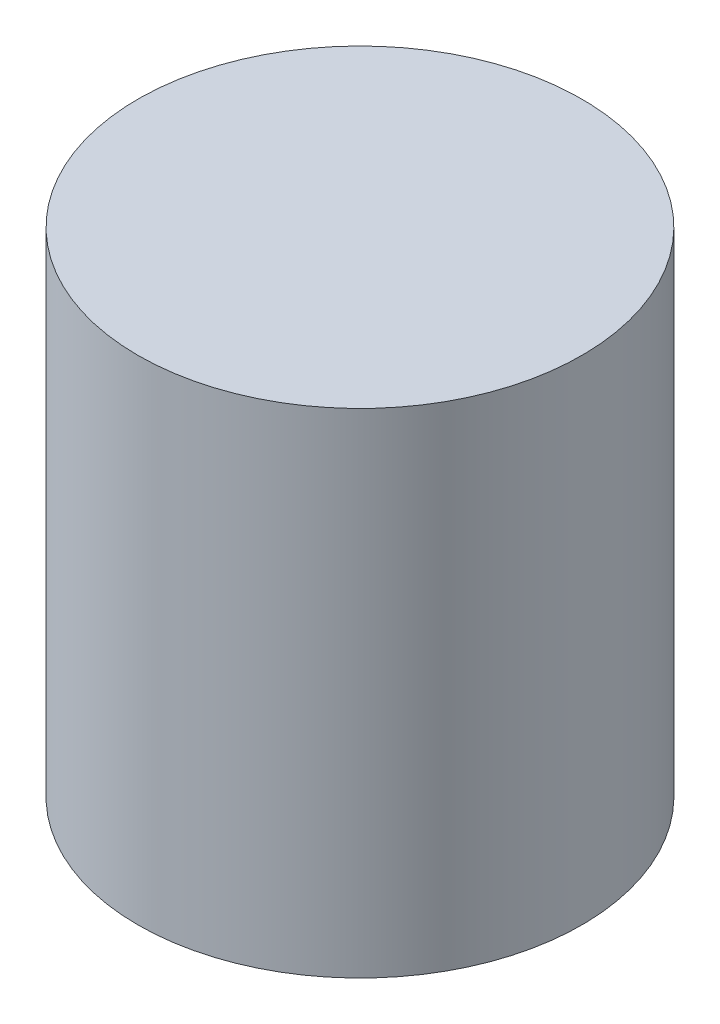
ISO-10303-21;
HEADER;
FILE_DESCRIPTION(('STEP AP214'),'2;1');
FILE_NAME('part.step','',(''),(''),'','','');
FILE_SCHEMA(('AUTOMOTIVE_DESIGN { 1 0 10303 214 1 1 1 1 }'));
ENDSEC;
DATA;
#1=APPLICATION_CONTEXT('core data for automotive mechanical design processes');
#2=APPLICATION_PROTOCOL_DEFINITION('international standard','automotive_design',2000,#1);
#3=PRODUCT_CONTEXT('',#1,'mechanical');
#4=PRODUCT('Part','Part','',(#3));
#5=PRODUCT_RELATED_PRODUCT_CATEGORY('part','',(#4));
#6=PRODUCT_DEFINITION_FORMATION('','',#4);
#7=PRODUCT_DEFINITION_CONTEXT('part definition',#1,'design');
#8=PRODUCT_DEFINITION('design','',#6,#7);
#9=PRODUCT_DEFINITION_SHAPE('','',#8);
#10=(LENGTH_UNIT() NAMED_UNIT(*) SI_UNIT(.MILLI.,.METRE.));
#11=(NAMED_UNIT(*) PLANE_ANGLE_UNIT() SI_UNIT($,.RADIAN.));
#12=(NAMED_UNIT(*) SI_UNIT($,.STERADIAN.) SOLID_ANGLE_UNIT());
#13=UNCERTAINTY_MEASURE_WITH_UNIT(LENGTH_MEASURE(1.E-05),#10,'distance_accuracy_value','');
#14=(GEOMETRIC_REPRESENTATION_CONTEXT(3) GLOBAL_UNCERTAINTY_ASSIGNED_CONTEXT((#13)) GLOBAL_UNIT_ASSIGNED_CONTEXT((#10,
#11,#12)) REPRESENTATION_CONTEXT('',''));
#15=CARTESIAN_POINT('',(0.,0.,0.));
#16=DIRECTION('',(0.,0.,1.));
#17=DIRECTION('',(1.,0.,0.));
#18=AXIS2_PLACEMENT_3D('',#15,#16,#17);
#19=CARTESIAN_POINT('',(0.,100.,0.));
#20=DIRECTION('',(0.,-1.,0.));
#21=DIRECTION('',(0.,0.,-1.));
#22=AXIS2_PLACEMENT_3D('',#19,#20,#21);
#23=CYLINDRICAL_SURFACE('',#22,45.);
#24=CARTESIAN_POINT('',(0.,100.,0.));
#25=DIRECTION('',(0.,1.,0.));
#26=DIRECTION('',(0.,0.,1.));
#27=AXIS2_PLACEMENT_3D('',#24,#25,#26);
#28=CIRCLE('',#27,45.);
#29=CARTESIAN_POINT('',(0.,100.,45.));
#30=VERTEX_POINT('',#29);
#31=EDGE_CURVE('E10',#30,#30,#28,.T.);
#32=ORIENTED_EDGE('',*,*,#31,.F.);
#33=EDGE_LOOP('',(#32));
#34=FACE_BOUND('',#33,.T.);
#35=CARTESIAN_POINT('',(0.,0.,0.));
#36=DIRECTION('',(0.,1.,0.));
#37=DIRECTION('',(0.,0.,1.));
#38=AXIS2_PLACEMENT_3D('',#35,#36,#37);
#39=CIRCLE('',#38,45.);
#40=CARTESIAN_POINT('',(0.,0.,45.));
#41=VERTEX_POINT('',#40);
#42=EDGE_CURVE('E34',#41,#41,#39,.T.);
#43=ORIENTED_EDGE('',*,*,#42,.T.);
#44=EDGE_LOOP('',(#43));
#45=FACE_BOUND('',#44,.T.);
#46=ADVANCED_FACE('F31',(#34,#45),#23,.T.);
#47=CARTESIAN_POINT('',(0.,100.,0.));
#48=DIRECTION('',(0.,1.,0.));
#49=DIRECTION('',(0.,0.,1.));
#50=AXIS2_PLACEMENT_3D('',#47,#48,#49);
#51=PLANE('',#50);
#52=ORIENTED_EDGE('',*,*,#31,.T.);
#53=EDGE_LOOP('',(#52));
#54=FACE_BOUND('',#53,.T.);
#55=ADVANCED_FACE('F46',(#54),#51,.T.);
#56=CARTESIAN_POINT('',(0.,0.,0.));
#57=DIRECTION('',(0.,1.,0.));
#58=DIRECTION('',(0.,0.,1.));
#59=AXIS2_PLACEMENT_3D('',#56,#57,#58);
#60=PLANE('',#59);
#61=ORIENTED_EDGE('',*,*,#42,.F.);
#62=EDGE_LOOP('',(#61));
#63=FACE_BOUND('',#62,.T.);
#64=ADVANCED_FACE('F44',(#63),#60,.F.);
#65=CLOSED_SHELL('',(#46,#55,#64));
#66=MANIFOLD_SOLID_BREP('B2',#65);
#67=ADVANCED_BREP_SHAPE_REPRESENTATION('',(#18,#66),#14);
#68=SHAPE_DEFINITION_REPRESENTATION(#9,#67);
ENDSEC;
END-ISO-10303-21;
